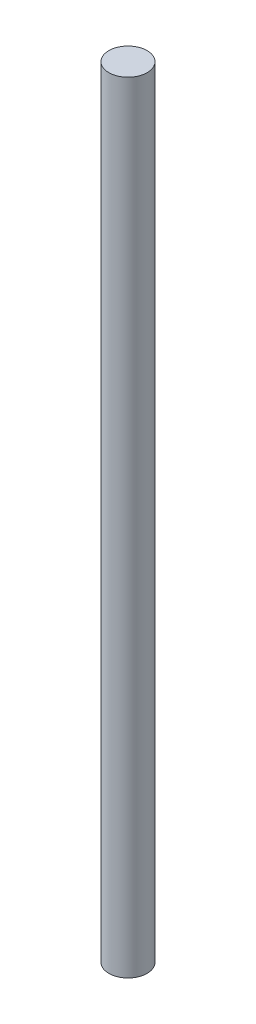
ISO-10303-21;
HEADER;
FILE_DESCRIPTION(('STEP AP214'),'2;1');
FILE_NAME('part.step','',(''),(''),'','','');
FILE_SCHEMA(('AUTOMOTIVE_DESIGN { 1 0 10303 214 1 1 1 1 }'));
ENDSEC;
DATA;
#1=APPLICATION_CONTEXT('core data for automotive mechanical design processes');
#2=APPLICATION_PROTOCOL_DEFINITION('international standard','automotive_design',2000,#1);
#3=PRODUCT_CONTEXT('',#1,'mechanical');
#4=PRODUCT('Part','Part','',(#3));
#5=PRODUCT_RELATED_PRODUCT_CATEGORY('part','',(#4));
#6=PRODUCT_DEFINITION_FORMATION('','',#4);
#7=PRODUCT_DEFINITION_CONTEXT('part definition',#1,'design');
#8=PRODUCT_DEFINITION('design','',#6,#7);
#9=PRODUCT_DEFINITION_SHAPE('','',#8);
#10=(LENGTH_UNIT() NAMED_UNIT(*) SI_UNIT(.MILLI.,.METRE.));
#11=(NAMED_UNIT(*) PLANE_ANGLE_UNIT() SI_UNIT($,.RADIAN.));
#12=(NAMED_UNIT(*) SI_UNIT($,.STERADIAN.) SOLID_ANGLE_UNIT());
#13=UNCERTAINTY_MEASURE_WITH_UNIT(LENGTH_MEASURE(1.E-05),#10,'distance_accuracy_value','');
#14=(GEOMETRIC_REPRESENTATION_CONTEXT(3) GLOBAL_UNCERTAINTY_ASSIGNED_CONTEXT((#13)) GLOBAL_UNIT_ASSIGNED_CONTEXT((#10,
#11,#12)) REPRESENTATION_CONTEXT('',''));
#15=CARTESIAN_POINT('',(0.,0.,0.));
#16=DIRECTION('',(0.,0.,1.));
#17=DIRECTION('',(1.,0.,0.));
#18=AXIS2_PLACEMENT_3D('',#15,#16,#17);
#19=CARTESIAN_POINT('',(0.,102.,0.));
#20=DIRECTION('',(0.,-1.,0.));
#21=DIRECTION('',(0.,0.,-1.));
#22=AXIS2_PLACEMENT_3D('',#19,#20,#21);
#23=CYLINDRICAL_SURFACE('',#22,2.5);
#24=CARTESIAN_POINT('',(0.,102.,0.));
#25=DIRECTION('',(0.,1.,0.));
#26=DIRECTION('',(0.,0.,1.));
#27=AXIS2_PLACEMENT_3D('',#24,#25,#26);
#28=CIRCLE('',#27,2.5);
#29=CARTESIAN_POINT('',(0.,102.,2.5));
#30=VERTEX_POINT('',#29);
#31=EDGE_CURVE('E10',#30,#30,#28,.T.);
#32=ORIENTED_EDGE('',*,*,#31,.F.);
#33=EDGE_LOOP('',(#32));
#34=FACE_BOUND('',#33,.T.);
#35=CARTESIAN_POINT('',(0.,0.,0.));
#36=DIRECTION('',(0.,1.,0.));
#37=DIRECTION('',(0.,0.,1.));
#38=AXIS2_PLACEMENT_3D('',#35,#36,#37);
#39=CIRCLE('',#38,2.5);
#40=CARTESIAN_POINT('',(0.,0.,2.5));
#41=VERTEX_POINT('',#40);
#42=EDGE_CURVE('E40',#41,#41,#39,.T.);
#43=ORIENTED_EDGE('',*,*,#42,.T.);
#44=EDGE_LOOP('',(#43));
#45=FACE_BOUND('',#44,.T.);
#46=ADVANCED_FACE('F37',(#34,#45),#23,.T.);
#47=CARTESIAN_POINT('',(0.,102.,0.));
#48=DIRECTION('',(0.,1.,0.));
#49=DIRECTION('',(0.,0.,1.));
#50=AXIS2_PLACEMENT_3D('',#47,#48,#49);
#51=PLANE('',#50);
#52=ORIENTED_EDGE('',*,*,#31,.T.);
#53=EDGE_LOOP('',(#52));
#54=FACE_BOUND('',#53,.T.);
#55=ADVANCED_FACE('F52',(#54),#51,.T.);
#56=CARTESIAN_POINT('',(0.,0.,0.));
#57=DIRECTION('',(0.,1.,0.));
#58=DIRECTION('',(0.,0.,1.));
#59=AXIS2_PLACEMENT_3D('',#56,#57,#58);
#60=PLANE('',#59);
#61=ORIENTED_EDGE('',*,*,#42,.F.);
#62=EDGE_LOOP('',(#61));
#63=FACE_BOUND('',#62,.T.);
#64=ADVANCED_FACE('F50',(#63),#60,.F.);
#65=CLOSED_SHELL('',(#46,#55,#64));
#66=MANIFOLD_SOLID_BREP('B2',#65);
#67=ADVANCED_BREP_SHAPE_REPRESENTATION('',(#18,#66),#14);
#68=SHAPE_DEFINITION_REPRESENTATION(#9,#67);
ENDSEC;
END-ISO-10303-21;
